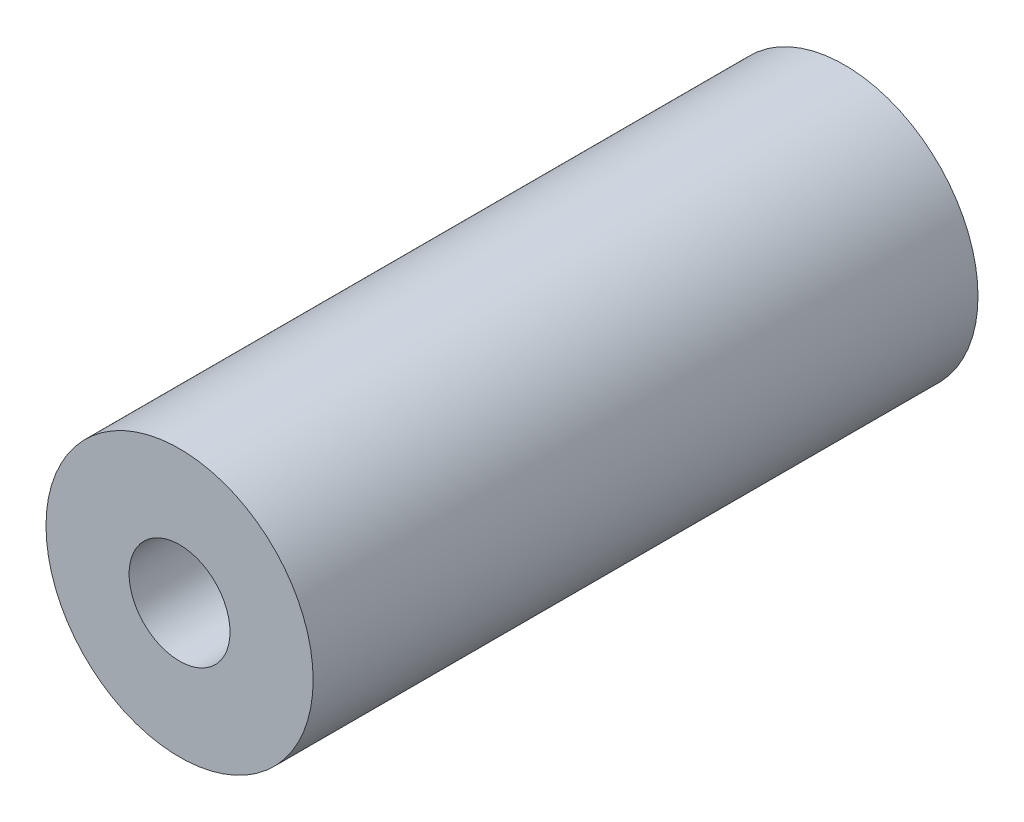
ISO-10303-21;
HEADER;
FILE_DESCRIPTION(('STEP AP214'),'2;1');
FILE_NAME('part.step','',(''),(''),'','','');
FILE_SCHEMA(('AUTOMOTIVE_DESIGN { 1 0 10303 214 1 1 1 1 }'));
ENDSEC;
DATA;
#1=APPLICATION_CONTEXT('core data for automotive mechanical design processes');
#2=APPLICATION_PROTOCOL_DEFINITION('international standard','automotive_design',2000,#1);
#3=PRODUCT_CONTEXT('',#1,'mechanical');
#4=PRODUCT('Part','Part','',(#3));
#5=PRODUCT_RELATED_PRODUCT_CATEGORY('part','',(#4));
#6=PRODUCT_DEFINITION_FORMATION('','',#4);
#7=PRODUCT_DEFINITION_CONTEXT('part definition',#1,'design');
#8=PRODUCT_DEFINITION('design','',#6,#7);
#9=PRODUCT_DEFINITION_SHAPE('','',#8);
#10=(LENGTH_UNIT() NAMED_UNIT(*) SI_UNIT(.MILLI.,.METRE.));
#11=(NAMED_UNIT(*) PLANE_ANGLE_UNIT() SI_UNIT($,.RADIAN.));
#12=(NAMED_UNIT(*) SI_UNIT($,.STERADIAN.) SOLID_ANGLE_UNIT());
#13=UNCERTAINTY_MEASURE_WITH_UNIT(LENGTH_MEASURE(1.E-05),#10,'distance_accuracy_value','');
#14=(GEOMETRIC_REPRESENTATION_CONTEXT(3) GLOBAL_UNCERTAINTY_ASSIGNED_CONTEXT((#13)) GLOBAL_UNIT_ASSIGNED_CONTEXT((#10,
#11,#12)) REPRESENTATION_CONTEXT('',''));
#15=CARTESIAN_POINT('',(0.,0.,0.));
#16=DIRECTION('',(0.,0.,1.));
#17=DIRECTION('',(1.,0.,0.));
#18=AXIS2_PLACEMENT_3D('',#15,#16,#17);
#19=CARTESIAN_POINT('',(3.46944695195361E-13,0.,152.400000000004));
#20=DIRECTION('',(0.,0.,1.00000000000002));
#21=DIRECTION('',(1.00000000000002,0.,0.));
#22=AXIS2_PLACEMENT_3D('',#19,#20,#21);
#23=PLANE('',#22);
#24=CARTESIAN_POINT('',(3.46944695195361E-13,0.,152.400000000004));
#25=DIRECTION('',(0.,0.,1.00000000000002));
#26=DIRECTION('',(1.00000000000002,0.,0.));
#27=AXIS2_PLACEMENT_3D('',#24,#25,#26);
#28=CIRCLE('',#27,30.61716);
#29=CARTESIAN_POINT('',(30.617160000001,0.,152.400000000004));
#30=VERTEX_POINT('',#29);
#31=EDGE_CURVE('E10',#30,#30,#28,.T.);
#32=ORIENTED_EDGE('',*,*,#31,.T.);
#33=EDGE_LOOP('',(#32));
#34=FACE_BOUND('',#33,.T.);
#35=CARTESIAN_POINT('',(3.46944695195361E-13,0.,152.400000000004));
#36=DIRECTION('',(0.,0.,1.00000000000002));
#37=DIRECTION('',(1.00000000000002,0.,0.));
#38=AXIS2_PLACEMENT_3D('',#35,#36,#37);
#39=CIRCLE('',#38,11.56716);
#40=CARTESIAN_POINT('',(11.5671600000006,0.,152.400000000004));
#41=VERTEX_POINT('',#40);
#42=EDGE_CURVE('E44',#41,#41,#39,.T.);
#43=ORIENTED_EDGE('',*,*,#42,.F.);
#44=EDGE_LOOP('',(#43));
#45=FACE_BOUND('',#44,.T.);
#46=ADVANCED_FACE('F30',(#34,#45),#23,.T.);
#47=CARTESIAN_POINT('',(0.,0.,0.));
#48=DIRECTION('',(0.,0.,1.00000000000002));
#49=DIRECTION('',(1.00000000000002,0.,0.));
#50=AXIS2_PLACEMENT_3D('',#47,#48,#49);
#51=PLANE('',#50);
#52=CARTESIAN_POINT('',(0.,0.,0.));
#53=DIRECTION('',(0.,0.,1.00000000000002));
#54=DIRECTION('',(1.00000000000002,0.,0.));
#55=AXIS2_PLACEMENT_3D('',#52,#53,#54);
#56=CIRCLE('',#55,30.61716);
#57=CARTESIAN_POINT('',(30.6171600000007,0.,0.));
#58=VERTEX_POINT('',#57);
#59=EDGE_CURVE('E34',#58,#58,#56,.T.);
#60=ORIENTED_EDGE('',*,*,#59,.F.);
#61=EDGE_LOOP('',(#60));
#62=FACE_BOUND('',#61,.T.);
#63=CARTESIAN_POINT('',(0.,0.,0.));
#64=DIRECTION('',(0.,0.,1.00000000000002));
#65=DIRECTION('',(1.00000000000002,0.,0.));
#66=AXIS2_PLACEMENT_3D('',#63,#64,#65);
#67=CIRCLE('',#66,11.56716);
#68=CARTESIAN_POINT('',(11.5671600000003,0.,0.));
#69=VERTEX_POINT('',#68);
#70=EDGE_CURVE('E46',#69,#69,#67,.T.);
#71=ORIENTED_EDGE('',*,*,#70,.T.);
#72=EDGE_LOOP('',(#71));
#73=FACE_BOUND('',#72,.T.);
#74=ADVANCED_FACE('F59',(#62,#73),#51,.F.);
#75=CARTESIAN_POINT('',(3.46944695195361E-13,0.,152.400000000004));
#76=DIRECTION('',(0.,0.,-1.00000000000002));
#77=DIRECTION('',(-1.00000000000002,0.,0.));
#78=AXIS2_PLACEMENT_3D('',#75,#76,#77);
#79=CYLINDRICAL_SURFACE('',#78,30.61716);
#80=ORIENTED_EDGE('',*,*,#31,.F.);
#81=EDGE_LOOP('',(#80));
#82=FACE_BOUND('',#81,.T.);
#83=ORIENTED_EDGE('',*,*,#59,.T.);
#84=EDGE_LOOP('',(#83));
#85=FACE_BOUND('',#84,.T.);
#86=ADVANCED_FACE('F32',(#82,#85),#79,.T.);
#87=CARTESIAN_POINT('',(3.46944695195361E-13,0.,152.400000000004));
#88=DIRECTION('',(0.,0.,-1.00000000000002));
#89=DIRECTION('',(-1.00000000000002,0.,0.));
#90=AXIS2_PLACEMENT_3D('',#87,#88,#89);
#91=CYLINDRICAL_SURFACE('',#90,11.56716);
#92=ORIENTED_EDGE('',*,*,#42,.T.);
#93=EDGE_LOOP('',(#92));
#94=FACE_BOUND('',#93,.T.);
#95=ORIENTED_EDGE('',*,*,#70,.F.);
#96=EDGE_LOOP('',(#95));
#97=FACE_BOUND('',#96,.T.);
#98=ADVANCED_FACE('F55',(#94,#97),#91,.F.);
#99=CLOSED_SHELL('',(#46,#74,#86,#98));
#100=MANIFOLD_SOLID_BREP('B2',#99);
#101=ADVANCED_BREP_SHAPE_REPRESENTATION('',(#18,#100),#14);
#102=SHAPE_DEFINITION_REPRESENTATION(#9,#101);
ENDSEC;
END-ISO-10303-21;
